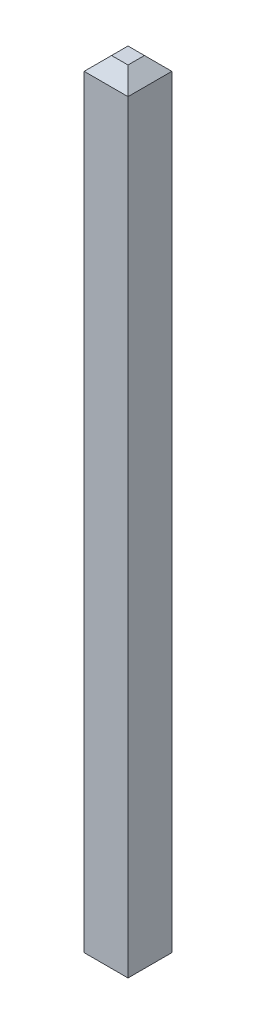
ISO-10303-21;
HEADER;
FILE_DESCRIPTION(('STEP AP214'),'2;1');
FILE_NAME('part.step','',(''),(''),'','','');
FILE_SCHEMA(('AUTOMOTIVE_DESIGN { 1 0 10303 214 1 1 1 1 }'));
ENDSEC;
DATA;
#1=APPLICATION_CONTEXT('core data for automotive mechanical design processes');
#2=APPLICATION_PROTOCOL_DEFINITION('international standard','automotive_design',2000,#1);
#3=PRODUCT_CONTEXT('',#1,'mechanical');
#4=PRODUCT('Part','Part','',(#3));
#5=PRODUCT_RELATED_PRODUCT_CATEGORY('part','',(#4));
#6=PRODUCT_DEFINITION_FORMATION('','',#4);
#7=PRODUCT_DEFINITION_CONTEXT('part definition',#1,'design');
#8=PRODUCT_DEFINITION('design','',#6,#7);
#9=PRODUCT_DEFINITION_SHAPE('','',#8);
#10=(LENGTH_UNIT() NAMED_UNIT(*) SI_UNIT(.MILLI.,.METRE.));
#11=(NAMED_UNIT(*) PLANE_ANGLE_UNIT() SI_UNIT($,.RADIAN.));
#12=(NAMED_UNIT(*) SI_UNIT($,.STERADIAN.) SOLID_ANGLE_UNIT());
#13=UNCERTAINTY_MEASURE_WITH_UNIT(LENGTH_MEASURE(1.E-05),#10,'distance_accuracy_value','');
#14=(GEOMETRIC_REPRESENTATION_CONTEXT(3) GLOBAL_UNCERTAINTY_ASSIGNED_CONTEXT((#13)) GLOBAL_UNIT_ASSIGNED_CONTEXT((#10,
#11,#12)) REPRESENTATION_CONTEXT('',''));
#15=CARTESIAN_POINT('',(0.,0.,0.));
#16=DIRECTION('',(0.,0.,1.));
#17=DIRECTION('',(1.,0.,0.));
#18=AXIS2_PLACEMENT_3D('',#15,#16,#17);
#19=CARTESIAN_POINT('',(-1.59,7.27,0.12));
#20=DIRECTION('',(0.,-0.707106781186548,-0.707106781186548));
#21=DIRECTION('',(0.,0.707106781186548,-0.707106781186548));
#22=AXIS2_PLACEMENT_3D('',#19,#20,#21);
#23=PLANE('',#22);
#24=DIRECTION('',(1.,0.,0.));
#25=VECTOR('',#24,1.);
#26=CARTESIAN_POINT('',(-1.59,7.27,0.12));
#27=LINE('',#26,#25);
#28=CARTESIAN_POINT('',(-1.15,7.27,0.12));
#29=VERTEX_POINT('',#28);
#30=CARTESIAN_POINT('',(-1.39,7.27,0.12));
#31=VERTEX_POINT('',#30);
#32=EDGE_CURVE('E79',#29,#31,#27,.F.);
#33=ORIENTED_EDGE('',*,*,#32,.T.);
#34=DIRECTION('',(-0.577350269189625,-0.577350269189625,0.577350269189627));
#35=VECTOR('',#34,1.);
#36=CARTESIAN_POINT('',(-1.39,7.27,0.12));
#37=LINE('',#36,#35);
#38=CARTESIAN_POINT('',(-1.59,7.07,0.32));
#39=VERTEX_POINT('',#38);
#40=EDGE_CURVE('E20',#31,#39,#37,.T.);
#41=ORIENTED_EDGE('',*,*,#40,.T.);
#42=DIRECTION('',(-1.,0.,0.));
#43=VECTOR('',#42,1.);
#44=CARTESIAN_POINT('',(-1.27,7.07,0.320000000000001));
#45=LINE('',#44,#43);
#46=CARTESIAN_POINT('',(-0.95,7.07,0.319999999999999));
#47=VERTEX_POINT('',#46);
#48=EDGE_CURVE('E100',#39,#47,#45,.F.);
#49=ORIENTED_EDGE('',*,*,#48,.T.);
#50=DIRECTION('',(-0.577350269189625,0.577350269189626,-0.577350269189627));
#51=VECTOR('',#50,1.);
#52=CARTESIAN_POINT('',(-0.95,7.07,0.32));
#53=LINE('',#52,#51);
#54=EDGE_CURVE('E85',#47,#29,#53,.T.);
#55=ORIENTED_EDGE('',*,*,#54,.T.);
#56=EDGE_LOOP('',(#33,#41,#49,#55));
#57=FACE_BOUND('',#56,.T.);
#58=ADVANCED_FACE('F17',(#57),#23,.F.);
#59=CARTESIAN_POINT('',(-0.95,-4.27,0.12));
#60=DIRECTION('',(0.,0.707106781186548,-0.707106781186548));
#61=DIRECTION('',(0.,0.707106781186548,0.707106781186548));
#62=AXIS2_PLACEMENT_3D('',#59,#60,#61);
#63=PLANE('',#62);
#64=DIRECTION('',(-1.,0.,0.));
#65=VECTOR('',#64,1.);
#66=CARTESIAN_POINT('',(-1.27,-4.07,0.319999999999999));
#67=LINE('',#66,#65);
#68=CARTESIAN_POINT('',(-0.949999999999999,-4.07,0.32));
#69=VERTEX_POINT('',#68);
#70=CARTESIAN_POINT('',(-1.59,-4.07,0.32));
#71=VERTEX_POINT('',#70);
#72=EDGE_CURVE('E98',#69,#71,#67,.T.);
#73=ORIENTED_EDGE('',*,*,#72,.T.);
#74=DIRECTION('',(0.577350269189625,-0.577350269189625,-0.577350269189627));
#75=VECTOR('',#74,1.);
#76=CARTESIAN_POINT('',(-1.59,-4.07,0.32));
#77=LINE('',#76,#75);
#78=CARTESIAN_POINT('',(-1.39,-4.27,0.12));
#79=VERTEX_POINT('',#78);
#80=EDGE_CURVE('E107',#71,#79,#77,.T.);
#81=ORIENTED_EDGE('',*,*,#80,.T.);
#82=DIRECTION('',(1.,0.,0.));
#83=VECTOR('',#82,1.);
#84=CARTESIAN_POINT('',(-0.95,-4.27,0.12));
#85=LINE('',#84,#83);
#86=CARTESIAN_POINT('',(-1.15,-4.27,0.12));
#87=VERTEX_POINT('',#86);
#88=EDGE_CURVE('E114',#79,#87,#85,.T.);
#89=ORIENTED_EDGE('',*,*,#88,.T.);
#90=DIRECTION('',(0.577350269189625,0.577350269189626,0.577350269189627));
#91=VECTOR('',#90,1.);
#92=CARTESIAN_POINT('',(-1.15,-4.27,0.12));
#93=LINE('',#92,#91);
#94=EDGE_CURVE('E109',#87,#69,#93,.T.);
#95=ORIENTED_EDGE('',*,*,#94,.T.);
#96=EDGE_LOOP('',(#73,#81,#89,#95));
#97=FACE_BOUND('',#96,.T.);
#98=ADVANCED_FACE('F176',(#97),#63,.F.);
#99=CARTESIAN_POINT('',(-1.39,7.27,-0.32));
#100=DIRECTION('',(0.707106781186548,-0.707106781186548,0.));
#101=DIRECTION('',(0.707106781186548,0.707106781186548,0.));
#102=AXIS2_PLACEMENT_3D('',#99,#100,#101);
#103=PLANE('',#102);
#104=DIRECTION('',(0.,0.,1.));
#105=VECTOR('',#104,1.);
#106=CARTESIAN_POINT('',(-1.39,7.27,-0.32));
#107=LINE('',#106,#105);
#108=CARTESIAN_POINT('',(-1.39,7.27,-0.12));
#109=VERTEX_POINT('',#108);
#110=EDGE_CURVE('E87',#31,#109,#107,.F.);
#111=ORIENTED_EDGE('',*,*,#110,.T.);
#112=DIRECTION('',(0.577350269189627,0.577350269189625,0.577350269189626));
#113=VECTOR('',#112,1.);
#114=CARTESIAN_POINT('',(-1.59,7.07,-0.320000000000001));
#115=LINE('',#114,#113);
#116=CARTESIAN_POINT('',(-1.59,7.07,-0.32));
#117=VERTEX_POINT('',#116);
#118=EDGE_CURVE('E124',#117,#109,#115,.T.);
#119=ORIENTED_EDGE('',*,*,#118,.F.);
#120=DIRECTION('',(0.,0.,-1.));
#121=VECTOR('',#120,1.);
#122=CARTESIAN_POINT('',(-1.59,7.07,-0.32));
#123=LINE('',#122,#121);
#124=EDGE_CURVE('E92',#117,#39,#123,.F.);
#125=ORIENTED_EDGE('',*,*,#124,.T.);
#126=ORIENTED_EDGE('',*,*,#40,.F.);
#127=EDGE_LOOP('',(#111,#119,#125,#126));
#128=FACE_BOUND('',#127,.T.);
#129=ADVANCED_FACE('F89',(#128),#103,.F.);
#130=CARTESIAN_POINT('',(-1.59,7.27,-0.32));
#131=DIRECTION('',(0.,-1.,0.));
#132=DIRECTION('',(1.,0.,0.));
#133=AXIS2_PLACEMENT_3D('',#130,#131,#132);
#134=PLANE('',#133);
#135=DIRECTION('',(1.,0.,0.));
#136=VECTOR('',#135,1.);
#137=CARTESIAN_POINT('',(-1.27,7.27,-0.120000000000001));
#138=LINE('',#137,#136);
#139=CARTESIAN_POINT('',(-1.15,7.27,-0.12));
#140=VERTEX_POINT('',#139);
#141=EDGE_CURVE('E96',#109,#140,#138,.T.);
#142=ORIENTED_EDGE('',*,*,#141,.F.);
#143=ORIENTED_EDGE('',*,*,#110,.F.);
#144=ORIENTED_EDGE('',*,*,#32,.F.);
#145=DIRECTION('',(0.,0.,1.));
#146=VECTOR('',#145,1.);
#147=CARTESIAN_POINT('',(-1.15,7.27,-0.32));
#148=LINE('',#147,#146);
#149=EDGE_CURVE('E104',#29,#140,#148,.F.);
#150=ORIENTED_EDGE('',*,*,#149,.T.);
#151=EDGE_LOOP('',(#142,#143,#144,#150));
#152=FACE_BOUND('',#151,.T.);
#153=ADVANCED_FACE('F94',(#152),#134,.F.);
#154=CARTESIAN_POINT('',(-1.27,1.5,0.32));
#155=DIRECTION('',(0.,0.,-1.));
#156=DIRECTION('',(-1.,0.,0.));
#157=AXIS2_PLACEMENT_3D('',#154,#155,#156);
#158=PLANE('',#157);
#159=ORIENTED_EDGE('',*,*,#48,.F.);
#160=DIRECTION('',(0.,1.,0.));
#161=VECTOR('',#160,1.);
#162=CARTESIAN_POINT('',(-1.59,-4.27,0.32));
#163=LINE('',#162,#161);
#164=EDGE_CURVE('E121',#39,#71,#163,.F.);
#165=ORIENTED_EDGE('',*,*,#164,.T.);
#166=ORIENTED_EDGE('',*,*,#72,.F.);
#167=DIRECTION('',(0.,-1.,0.));
#168=VECTOR('',#167,1.);
#169=CARTESIAN_POINT('',(-0.95,7.27,0.32));
#170=LINE('',#169,#168);
#171=EDGE_CURVE('E132',#69,#47,#170,.F.);
#172=ORIENTED_EDGE('',*,*,#171,.T.);
#173=EDGE_LOOP('',(#159,#165,#166,#172));
#174=FACE_BOUND('',#173,.T.);
#175=ADVANCED_FACE('F213',(#174),#158,.F.);
#176=CARTESIAN_POINT('',(-0.95,7.07,-0.32));
#177=DIRECTION('',(-0.707106781186548,-0.707106781186548,0.));
#178=DIRECTION('',(0.707106781186548,-0.707106781186548,0.));
#179=AXIS2_PLACEMENT_3D('',#176,#177,#178);
#180=PLANE('',#179);
#181=DIRECTION('',(0.,0.,1.));
#182=VECTOR('',#181,1.);
#183=CARTESIAN_POINT('',(-0.95,7.07,-0.32));
#184=LINE('',#183,#182);
#185=CARTESIAN_POINT('',(-0.95,7.07,-0.32));
#186=VERTEX_POINT('',#185);
#187=EDGE_CURVE('E135',#47,#186,#184,.F.);
#188=ORIENTED_EDGE('',*,*,#187,.T.);
#189=DIRECTION('',(0.577350269189628,-0.577350269189627,-0.577350269189623));
#190=VECTOR('',#189,1.);
#191=CARTESIAN_POINT('',(-1.15,7.27,-0.12));
#192=LINE('',#191,#190);
#193=EDGE_CURVE('E127',#140,#186,#192,.T.);
#194=ORIENTED_EDGE('',*,*,#193,.F.);
#195=ORIENTED_EDGE('',*,*,#149,.F.);
#196=ORIENTED_EDGE('',*,*,#54,.F.);
#197=EDGE_LOOP('',(#188,#194,#195,#196));
#198=FACE_BOUND('',#197,.T.);
#199=ADVANCED_FACE('F188',(#198),#180,.F.);
#200=CARTESIAN_POINT('',(-1.59,-4.07,-0.32));
#201=DIRECTION('',(0.707106781186548,0.707106781186548,0.));
#202=DIRECTION('',(-0.707106781186548,0.707106781186548,0.));
#203=AXIS2_PLACEMENT_3D('',#200,#201,#202);
#204=PLANE('',#203);
#205=DIRECTION('',(0.,0.,1.));
#206=VECTOR('',#205,1.);
#207=CARTESIAN_POINT('',(-1.39,-4.27,-0.32));
#208=LINE('',#207,#206);
#209=CARTESIAN_POINT('',(-1.39,-4.27,-0.12));
#210=VERTEX_POINT('',#209);
#211=EDGE_CURVE('E111',#210,#79,#208,.T.);
#212=ORIENTED_EDGE('',*,*,#211,.T.);
#213=ORIENTED_EDGE('',*,*,#80,.F.);
#214=DIRECTION('',(0.,0.,-1.));
#215=VECTOR('',#214,1.);
#216=CARTESIAN_POINT('',(-1.59,-4.07,-0.32));
#217=LINE('',#216,#215);
#218=CARTESIAN_POINT('',(-1.59,-4.07,-0.32));
#219=VERTEX_POINT('',#218);
#220=EDGE_CURVE('E118',#71,#219,#217,.T.);
#221=ORIENTED_EDGE('',*,*,#220,.T.);
#222=DIRECTION('',(-0.577350269189627,0.577350269189625,-0.577350269189626));
#223=VECTOR('',#222,1.);
#224=CARTESIAN_POINT('',(-1.39,-4.27,-0.120000000000001));
#225=LINE('',#224,#223);
#226=EDGE_CURVE('E137',#210,#219,#225,.T.);
#227=ORIENTED_EDGE('',*,*,#226,.F.);
#228=EDGE_LOOP('',(#212,#213,#221,#227));
#229=FACE_BOUND('',#228,.T.);
#230=ADVANCED_FACE('F167',(#229),#204,.F.);
#231=CARTESIAN_POINT('',(-1.15,-4.27,-0.32));
#232=DIRECTION('',(-0.707106781186548,0.707106781186548,0.));
#233=DIRECTION('',(-0.707106781186548,-0.707106781186548,0.));
#234=AXIS2_PLACEMENT_3D('',#231,#232,#233);
#235=PLANE('',#234);
#236=DIRECTION('',(0.,0.,1.));
#237=VECTOR('',#236,1.);
#238=CARTESIAN_POINT('',(-0.949999999999987,-4.07,-0.32));
#239=LINE('',#238,#237);
#240=CARTESIAN_POINT('',(-0.949999999999997,-4.07,-0.32));
#241=VERTEX_POINT('',#240);
#242=EDGE_CURVE('E130',#241,#69,#239,.T.);
#243=ORIENTED_EDGE('',*,*,#242,.T.);
#244=ORIENTED_EDGE('',*,*,#94,.F.);
#245=DIRECTION('',(0.,0.,1.));
#246=VECTOR('',#245,1.);
#247=CARTESIAN_POINT('',(-1.15,-4.27,-0.32));
#248=LINE('',#247,#246);
#249=CARTESIAN_POINT('',(-1.15,-4.27,-0.12));
#250=VERTEX_POINT('',#249);
#251=EDGE_CURVE('E116',#87,#250,#248,.F.);
#252=ORIENTED_EDGE('',*,*,#251,.T.);
#253=DIRECTION('',(-0.577350269189627,-0.577350269189626,0.577350269189625));
#254=VECTOR('',#253,1.);
#255=CARTESIAN_POINT('',(-0.95,-4.07,-0.32));
#256=LINE('',#255,#254);
#257=EDGE_CURVE('E35',#241,#250,#256,.T.);
#258=ORIENTED_EDGE('',*,*,#257,.F.);
#259=EDGE_LOOP('',(#243,#244,#252,#258));
#260=FACE_BOUND('',#259,.T.);
#261=ADVANCED_FACE('F177',(#260),#235,.F.);
#262=CARTESIAN_POINT('',(-0.95,-4.27,-0.32));
#263=DIRECTION('',(0.,1.,0.));
#264=DIRECTION('',(0.,0.,1.));
#265=AXIS2_PLACEMENT_3D('',#262,#263,#264);
#266=PLANE('',#265);
#267=ORIENTED_EDGE('',*,*,#88,.F.);
#268=ORIENTED_EDGE('',*,*,#211,.F.);
#269=DIRECTION('',(1.,0.,0.));
#270=VECTOR('',#269,1.);
#271=CARTESIAN_POINT('',(-1.27,-4.27,-0.12));
#272=LINE('',#271,#270);
#273=EDGE_CURVE('E141',#250,#210,#272,.F.);
#274=ORIENTED_EDGE('',*,*,#273,.F.);
#275=ORIENTED_EDGE('',*,*,#251,.F.);
#276=EDGE_LOOP('',(#267,#268,#274,#275));
#277=FACE_BOUND('',#276,.T.);
#278=ADVANCED_FACE('F173',(#277),#266,.F.);
#279=CARTESIAN_POINT('',(-1.59,-4.27,-0.32));
#280=DIRECTION('',(1.,0.,0.));
#281=DIRECTION('',(0.,0.,-1.));
#282=AXIS2_PLACEMENT_3D('',#279,#280,#281);
#283=PLANE('',#282);
#284=ORIENTED_EDGE('',*,*,#124,.F.);
#285=DIRECTION('',(0.,1.,0.));
#286=VECTOR('',#285,1.);
#287=CARTESIAN_POINT('',(-1.59,1.5,-0.32));
#288=LINE('',#287,#286);
#289=EDGE_CURVE('E144',#219,#117,#288,.T.);
#290=ORIENTED_EDGE('',*,*,#289,.F.);
#291=ORIENTED_EDGE('',*,*,#220,.F.);
#292=ORIENTED_EDGE('',*,*,#164,.F.);
#293=EDGE_LOOP('',(#284,#290,#291,#292));
#294=FACE_BOUND('',#293,.T.);
#295=ADVANCED_FACE('F186',(#294),#283,.F.);
#296=CARTESIAN_POINT('',(-1.27,7.07,-0.32));
#297=DIRECTION('',(0.,0.707106781186548,-0.707106781186548));
#298=DIRECTION('',(0.,0.707106781186548,0.707106781186548));
#299=AXIS2_PLACEMENT_3D('',#296,#297,#298);
#300=PLANE('',#299);
#301=ORIENTED_EDGE('',*,*,#193,.T.);
#302=DIRECTION('',(-1.,0.,0.));
#303=VECTOR('',#302,1.);
#304=CARTESIAN_POINT('',(-1.27,7.07,-0.319999999999999));
#305=LINE('',#304,#303);
#306=EDGE_CURVE('E147',#117,#186,#305,.F.);
#307=ORIENTED_EDGE('',*,*,#306,.F.);
#308=ORIENTED_EDGE('',*,*,#118,.T.);
#309=ORIENTED_EDGE('',*,*,#141,.T.);
#310=EDGE_LOOP('',(#301,#307,#308,#309));
#311=FACE_BOUND('',#310,.T.);
#312=ADVANCED_FACE('F200',(#311),#300,.T.);
#313=CARTESIAN_POINT('',(-0.95,7.27,-0.32));
#314=DIRECTION('',(-1.,0.,0.));
#315=DIRECTION('',(0.,-1.,0.));
#316=AXIS2_PLACEMENT_3D('',#313,#314,#315);
#317=PLANE('',#316);
#318=ORIENTED_EDGE('',*,*,#187,.F.);
#319=ORIENTED_EDGE('',*,*,#171,.F.);
#320=ORIENTED_EDGE('',*,*,#242,.F.);
#321=DIRECTION('',(0.,1.,0.));
#322=VECTOR('',#321,1.);
#323=CARTESIAN_POINT('',(-0.95,1.5,-0.32));
#324=LINE('',#323,#322);
#325=EDGE_CURVE('E26',#186,#241,#324,.F.);
#326=ORIENTED_EDGE('',*,*,#325,.F.);
#327=EDGE_LOOP('',(#318,#319,#320,#326));
#328=FACE_BOUND('',#327,.T.);
#329=ADVANCED_FACE('F158',(#328),#317,.F.);
#330=CARTESIAN_POINT('',(-1.27,-4.07,-0.32));
#331=DIRECTION('',(0.,-0.707106781186548,-0.707106781186548));
#332=DIRECTION('',(0.,0.707106781186548,-0.707106781186548));
#333=AXIS2_PLACEMENT_3D('',#330,#331,#332);
#334=PLANE('',#333);
#335=ORIENTED_EDGE('',*,*,#257,.T.);
#336=ORIENTED_EDGE('',*,*,#273,.T.);
#337=ORIENTED_EDGE('',*,*,#226,.T.);
#338=DIRECTION('',(-1.,0.,0.));
#339=VECTOR('',#338,1.);
#340=CARTESIAN_POINT('',(-1.27,-4.07,-0.320000000000001));
#341=LINE('',#340,#339);
#342=EDGE_CURVE('E11',#241,#219,#341,.T.);
#343=ORIENTED_EDGE('',*,*,#342,.F.);
#344=EDGE_LOOP('',(#335,#336,#337,#343));
#345=FACE_BOUND('',#344,.T.);
#346=ADVANCED_FACE('F163',(#345),#334,.T.);
#347=CARTESIAN_POINT('',(-1.27,1.5,-0.32));
#348=DIRECTION('',(0.,0.,-1.));
#349=DIRECTION('',(-1.,0.,0.));
#350=AXIS2_PLACEMENT_3D('',#347,#348,#349);
#351=PLANE('',#350);
#352=ORIENTED_EDGE('',*,*,#325,.T.);
#353=ORIENTED_EDGE('',*,*,#342,.T.);
#354=ORIENTED_EDGE('',*,*,#289,.T.);
#355=ORIENTED_EDGE('',*,*,#306,.T.);
#356=EDGE_LOOP('',(#352,#353,#354,#355));
#357=FACE_BOUND('',#356,.T.);
#358=ADVANCED_FACE('F153',(#357),#351,.T.);
#359=CLOSED_SHELL('',(#58,#98,#129,#153,#175,#199,#230,#261,#278,#295,#312,#329,#346,#358));
#360=MANIFOLD_SOLID_BREP('B1',#359);
#361=ADVANCED_BREP_SHAPE_REPRESENTATION('',(#18,#360),#14);
#362=SHAPE_DEFINITION_REPRESENTATION(#9,#361);
ENDSEC;
END-ISO-10303-21;
